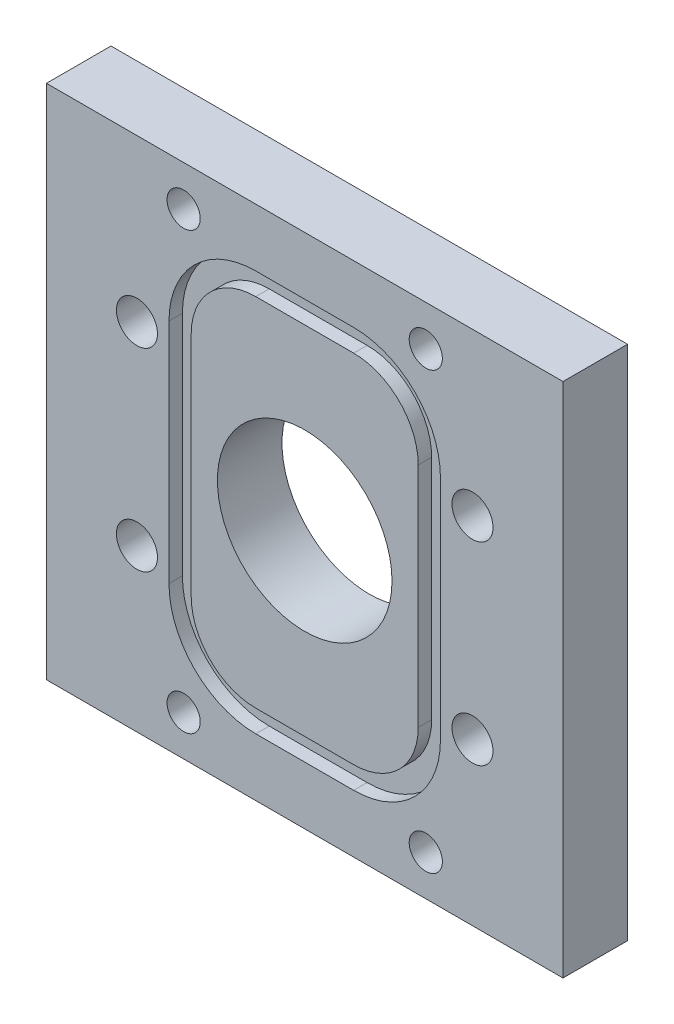
ISO-10303-21;
HEADER;
FILE_DESCRIPTION(('STEP AP214'),'2;1');
FILE_NAME('part.step','',(''),(''),'','','');
FILE_SCHEMA(('AUTOMOTIVE_DESIGN { 1 0 10303 214 1 1 1 1 }'));
ENDSEC;
DATA;
#1=APPLICATION_CONTEXT('core data for automotive mechanical design processes');
#2=APPLICATION_PROTOCOL_DEFINITION('international standard','automotive_design',2000,#1);
#3=PRODUCT_CONTEXT('',#1,'mechanical');
#4=PRODUCT('Part','Part','',(#3));
#5=PRODUCT_RELATED_PRODUCT_CATEGORY('part','',(#4));
#6=PRODUCT_DEFINITION_FORMATION('','',#4);
#7=PRODUCT_DEFINITION_CONTEXT('part definition',#1,'design');
#8=PRODUCT_DEFINITION('design','',#6,#7);
#9=PRODUCT_DEFINITION_SHAPE('','',#8);
#10=(LENGTH_UNIT() NAMED_UNIT(*) SI_UNIT(.MILLI.,.METRE.));
#11=(NAMED_UNIT(*) PLANE_ANGLE_UNIT() SI_UNIT($,.RADIAN.));
#12=(NAMED_UNIT(*) SI_UNIT($,.STERADIAN.) SOLID_ANGLE_UNIT());
#13=UNCERTAINTY_MEASURE_WITH_UNIT(LENGTH_MEASURE(1.E-05),#10,'distance_accuracy_value','');
#14=(GEOMETRIC_REPRESENTATION_CONTEXT(3) GLOBAL_UNCERTAINTY_ASSIGNED_CONTEXT((#13)) GLOBAL_UNIT_ASSIGNED_CONTEXT((#10,
#11,#12)) REPRESENTATION_CONTEXT('',''));
#15=CARTESIAN_POINT('',(0.,0.,0.));
#16=DIRECTION('',(0.,0.,1.));
#17=DIRECTION('',(1.,0.,0.));
#18=AXIS2_PLACEMENT_3D('',#15,#16,#17);
#19=CARTESIAN_POINT('',(25.4,25.4,6.35));
#20=DIRECTION('',(0.,0.,-1.));
#21=DIRECTION('',(-1.,0.,0.));
#22=AXIS2_PLACEMENT_3D('',#19,#20,#21);
#23=PLANE('',#22);
#24=CARTESIAN_POINT('',(0.,0.,6.35));
#25=DIRECTION('',(0.,0.,1.));
#26=DIRECTION('',(1.,0.,0.));
#27=AXIS2_PLACEMENT_3D('',#24,#25,#26);
#28=CIRCLE('',#27,8.5852);
#29=CARTESIAN_POINT('',(8.5852,0.,6.35));
#30=VERTEX_POINT('',#29);
#31=EDGE_CURVE('E296',#30,#30,#28,.T.);
#32=ORIENTED_EDGE('',*,*,#31,.F.);
#33=EDGE_LOOP('',(#32));
#34=FACE_BOUND('',#33,.T.);
#35=CARTESIAN_POINT('',(-4.8133,-11.176,6.35));
#36=DIRECTION('',(0.,0.,1.));
#37=DIRECTION('',(-1.,0.,0.));
#38=AXIS2_PLACEMENT_3D('',#35,#36,#37);
#39=CIRCLE('',#38,6.35);
#40=CARTESIAN_POINT('',(-11.1633,-11.176,6.35));
#41=VERTEX_POINT('',#40);
#42=CARTESIAN_POINT('',(-4.8133,-17.526,6.35));
#43=VERTEX_POINT('',#42);
#44=EDGE_CURVE('E220',#41,#43,#39,.T.);
#45=ORIENTED_EDGE('',*,*,#44,.T.);
#46=DIRECTION('',(1.,0.,0.));
#47=VECTOR('',#46,1.);
#48=CARTESIAN_POINT('',(-4.8133,-17.526,6.35));
#49=LINE('',#48,#47);
#50=CARTESIAN_POINT('',(4.8133,-17.526,6.35));
#51=VERTEX_POINT('',#50);
#52=EDGE_CURVE('E176',#43,#51,#49,.T.);
#53=ORIENTED_EDGE('',*,*,#52,.T.);
#54=CARTESIAN_POINT('',(4.8133,-11.176,6.35));
#55=DIRECTION('',(0.,0.,1.));
#56=DIRECTION('',(1.,0.,0.));
#57=AXIS2_PLACEMENT_3D('',#54,#55,#56);
#58=CIRCLE('',#57,6.35);
#59=CARTESIAN_POINT('',(11.1633,-11.176,6.35));
#60=VERTEX_POINT('',#59);
#61=EDGE_CURVE('E56',#51,#60,#58,.T.);
#62=ORIENTED_EDGE('',*,*,#61,.T.);
#63=DIRECTION('',(0.,1.,0.));
#64=VECTOR('',#63,1.);
#65=CARTESIAN_POINT('',(11.1633,-11.176,6.35));
#66=LINE('',#65,#64);
#67=CARTESIAN_POINT('',(11.1633,11.176,6.35));
#68=VERTEX_POINT('',#67);
#69=EDGE_CURVE('E224',#60,#68,#66,.T.);
#70=ORIENTED_EDGE('',*,*,#69,.T.);
#71=CARTESIAN_POINT('',(4.8133,11.176,6.35));
#72=DIRECTION('',(0.,0.,1.));
#73=DIRECTION('',(-1.,0.,0.));
#74=AXIS2_PLACEMENT_3D('',#71,#72,#73);
#75=CIRCLE('',#74,6.35);
#76=CARTESIAN_POINT('',(4.8133,17.526,6.35));
#77=VERTEX_POINT('',#76);
#78=EDGE_CURVE('E227',#68,#77,#75,.T.);
#79=ORIENTED_EDGE('',*,*,#78,.T.);
#80=DIRECTION('',(-1.,0.,0.));
#81=VECTOR('',#80,1.);
#82=CARTESIAN_POINT('',(-4.8133,17.526,6.35));
#83=LINE('',#82,#81);
#84=CARTESIAN_POINT('',(-4.8133,17.526,6.35));
#85=VERTEX_POINT('',#84);
#86=EDGE_CURVE('E230',#77,#85,#83,.T.);
#87=ORIENTED_EDGE('',*,*,#86,.T.);
#88=CARTESIAN_POINT('',(-4.8133,11.176,6.35));
#89=DIRECTION('',(0.,0.,1.));
#90=DIRECTION('',(-1.,0.,0.));
#91=AXIS2_PLACEMENT_3D('',#88,#89,#90);
#92=CIRCLE('',#91,6.35);
#93=CARTESIAN_POINT('',(-11.1633,11.176,6.35));
#94=VERTEX_POINT('',#93);
#95=EDGE_CURVE('E200',#85,#94,#92,.T.);
#96=ORIENTED_EDGE('',*,*,#95,.T.);
#97=DIRECTION('',(0.,-1.,0.));
#98=VECTOR('',#97,1.);
#99=CARTESIAN_POINT('',(-11.1633,-11.176,6.35));
#100=LINE('',#99,#98);
#101=EDGE_CURVE('E197',#94,#41,#100,.T.);
#102=ORIENTED_EDGE('',*,*,#101,.T.);
#103=EDGE_LOOP('',(#45,#53,#62,#70,#79,#87,#96,#102));
#104=FACE_BOUND('',#103,.T.);
#105=ADVANCED_FACE('F32',(#34,#104),#23,.F.);
#106=CARTESIAN_POINT('',(25.4,-25.4,6.35));
#107=DIRECTION('',(-1.,0.,0.));
#108=DIRECTION('',(0.,0.,1.));
#109=AXIS2_PLACEMENT_3D('',#106,#107,#108);
#110=PLANE('',#109);
#111=DIRECTION('',(0.,1.,0.));
#112=VECTOR('',#111,1.);
#113=CARTESIAN_POINT('',(25.4,-25.4,0.));
#114=LINE('',#113,#112);
#115=CARTESIAN_POINT('',(25.4,-25.4,0.));
#116=VERTEX_POINT('',#115);
#117=CARTESIAN_POINT('',(25.4,25.4,0.));
#118=VERTEX_POINT('',#117);
#119=EDGE_CURVE('E313',#116,#118,#114,.T.);
#120=ORIENTED_EDGE('',*,*,#119,.T.);
#121=DIRECTION('',(0.,0.,-1.));
#122=VECTOR('',#121,1.);
#123=CARTESIAN_POINT('',(25.4,25.4,6.35));
#124=LINE('',#123,#122);
#125=CARTESIAN_POINT('',(25.4,25.4,6.35));
#126=VERTEX_POINT('',#125);
#127=EDGE_CURVE('E11',#126,#118,#124,.T.);
#128=ORIENTED_EDGE('',*,*,#127,.F.);
#129=DIRECTION('',(0.,1.,0.));
#130=VECTOR('',#129,1.);
#131=CARTESIAN_POINT('',(25.4,-25.4,6.35));
#132=LINE('',#131,#130);
#133=CARTESIAN_POINT('',(25.4,-25.4,6.35));
#134=VERTEX_POINT('',#133);
#135=EDGE_CURVE('E316',#134,#126,#132,.T.);
#136=ORIENTED_EDGE('',*,*,#135,.F.);
#137=DIRECTION('',(0.,0.,-1.));
#138=VECTOR('',#137,1.);
#139=CARTESIAN_POINT('',(25.4,-25.4,6.35));
#140=LINE('',#139,#138);
#141=EDGE_CURVE('E326',#134,#116,#140,.T.);
#142=ORIENTED_EDGE('',*,*,#141,.T.);
#143=EDGE_LOOP('',(#120,#128,#136,#142));
#144=FACE_BOUND('',#143,.T.);
#145=ADVANCED_FACE('F34',(#144),#110,.F.);
#146=CARTESIAN_POINT('',(-25.4,25.4,6.35));
#147=DIRECTION('',(0.,-1.,0.));
#148=DIRECTION('',(0.,0.,-1.));
#149=AXIS2_PLACEMENT_3D('',#146,#147,#148);
#150=PLANE('',#149);
#151=DIRECTION('',(-1.,0.,0.));
#152=VECTOR('',#151,1.);
#153=CARTESIAN_POINT('',(-25.4,25.4,0.));
#154=LINE('',#153,#152);
#155=CARTESIAN_POINT('',(-25.4,25.4,0.));
#156=VERTEX_POINT('',#155);
#157=EDGE_CURVE('E329',#118,#156,#154,.T.);
#158=ORIENTED_EDGE('',*,*,#157,.T.);
#159=DIRECTION('',(0.,0.,-1.));
#160=VECTOR('',#159,1.);
#161=CARTESIAN_POINT('',(-25.4,25.4,6.35));
#162=LINE('',#161,#160);
#163=CARTESIAN_POINT('',(-25.4,25.4,6.35));
#164=VERTEX_POINT('',#163);
#165=EDGE_CURVE('E41',#164,#156,#162,.T.);
#166=ORIENTED_EDGE('',*,*,#165,.F.);
#167=DIRECTION('',(-1.,0.,0.));
#168=VECTOR('',#167,1.);
#169=CARTESIAN_POINT('',(-25.4,25.4,6.35));
#170=LINE('',#169,#168);
#171=EDGE_CURVE('E319',#126,#164,#170,.T.);
#172=ORIENTED_EDGE('',*,*,#171,.F.);
#173=ORIENTED_EDGE('',*,*,#127,.T.);
#174=EDGE_LOOP('',(#158,#166,#172,#173));
#175=FACE_BOUND('',#174,.T.);
#176=ADVANCED_FACE('F360',(#175),#150,.F.);
#177=CARTESIAN_POINT('',(-25.4,-25.4,6.35));
#178=DIRECTION('',(1.,0.,0.));
#179=DIRECTION('',(0.,0.,-1.));
#180=AXIS2_PLACEMENT_3D('',#177,#178,#179);
#181=PLANE('',#180);
#182=DIRECTION('',(0.,-1.,0.));
#183=VECTOR('',#182,1.);
#184=CARTESIAN_POINT('',(-25.4,-25.4,0.));
#185=LINE('',#184,#183);
#186=CARTESIAN_POINT('',(-25.4,-25.4,0.));
#187=VERTEX_POINT('',#186);
#188=EDGE_CURVE('E331',#156,#187,#185,.T.);
#189=ORIENTED_EDGE('',*,*,#188,.T.);
#190=DIRECTION('',(0.,0.,-1.));
#191=VECTOR('',#190,1.);
#192=CARTESIAN_POINT('',(-25.4,-25.4,6.35));
#193=LINE('',#192,#191);
#194=CARTESIAN_POINT('',(-25.4,-25.4,6.35));
#195=VERTEX_POINT('',#194);
#196=EDGE_CURVE('E336',#195,#187,#193,.T.);
#197=ORIENTED_EDGE('',*,*,#196,.F.);
#198=DIRECTION('',(0.,-1.,0.));
#199=VECTOR('',#198,1.);
#200=CARTESIAN_POINT('',(-25.4,-25.4,6.35));
#201=LINE('',#200,#199);
#202=EDGE_CURVE('E322',#164,#195,#201,.T.);
#203=ORIENTED_EDGE('',*,*,#202,.F.);
#204=ORIENTED_EDGE('',*,*,#165,.T.);
#205=EDGE_LOOP('',(#189,#197,#203,#204));
#206=FACE_BOUND('',#205,.T.);
#207=ADVANCED_FACE('F344',(#206),#181,.F.);
#208=CARTESIAN_POINT('',(-25.4,-25.4,6.35));
#209=DIRECTION('',(0.,1.,0.));
#210=DIRECTION('',(0.,0.,1.));
#211=AXIS2_PLACEMENT_3D('',#208,#209,#210);
#212=PLANE('',#211);
#213=DIRECTION('',(1.,0.,0.));
#214=VECTOR('',#213,1.);
#215=CARTESIAN_POINT('',(-25.4,-25.4,0.));
#216=LINE('',#215,#214);
#217=EDGE_CURVE('E320',#187,#116,#216,.T.);
#218=ORIENTED_EDGE('',*,*,#217,.T.);
#219=ORIENTED_EDGE('',*,*,#141,.F.);
#220=DIRECTION('',(1.,0.,0.));
#221=VECTOR('',#220,1.);
#222=CARTESIAN_POINT('',(-25.4,-25.4,6.35));
#223=LINE('',#222,#221);
#224=EDGE_CURVE('E324',#195,#134,#223,.T.);
#225=ORIENTED_EDGE('',*,*,#224,.F.);
#226=ORIENTED_EDGE('',*,*,#196,.T.);
#227=EDGE_LOOP('',(#218,#219,#225,#226));
#228=FACE_BOUND('',#227,.T.);
#229=ADVANCED_FACE('F353',(#228),#212,.F.);
#230=CARTESIAN_POINT('',(16.4977839420935,9.52500000000003,6.35));
#231=DIRECTION('',(0.,0.,-1.));
#232=DIRECTION('',(-1.,0.,0.));
#233=AXIS2_PLACEMENT_3D('',#230,#231,#232);
#234=CIRCLE('',#233,2.0193);
#235=CARTESIAN_POINT('',(14.4784839420935,9.52500000000003,6.35));
#236=VERTEX_POINT('',#235);
#237=EDGE_CURVE('E388',#236,#236,#234,.T.);
#238=ORIENTED_EDGE('',*,*,#237,.T.);
#239=EDGE_LOOP('',(#238));
#240=FACE_BOUND('',#239,.T.);
#241=CARTESIAN_POINT('',(16.4977839420935,-9.52500000000002,6.35));
#242=DIRECTION('',(0.,0.,-1.));
#243=DIRECTION('',(-1.,0.,0.));
#244=AXIS2_PLACEMENT_3D('',#241,#242,#243);
#245=CIRCLE('',#244,2.0193);
#246=CARTESIAN_POINT('',(14.4784839420935,-9.52500000000002,6.35));
#247=VERTEX_POINT('',#246);
#248=EDGE_CURVE('E392',#247,#247,#245,.T.);
#249=ORIENTED_EDGE('',*,*,#248,.T.);
#250=EDGE_LOOP('',(#249));
#251=FACE_BOUND('',#250,.T.);
#252=CARTESIAN_POINT('',(-16.4977839420935,9.52500000000003,6.35));
#253=DIRECTION('',(0.,0.,-1.));
#254=DIRECTION('',(-1.,0.,0.));
#255=AXIS2_PLACEMENT_3D('',#252,#253,#254);
#256=CIRCLE('',#255,2.0193);
#257=CARTESIAN_POINT('',(-18.5170839420935,9.52500000000003,6.35));
#258=VERTEX_POINT('',#257);
#259=EDGE_CURVE('E36',#258,#258,#256,.T.);
#260=ORIENTED_EDGE('',*,*,#259,.T.);
#261=EDGE_LOOP('',(#260));
#262=FACE_BOUND('',#261,.T.);
#263=CARTESIAN_POINT('',(-16.4977839420935,-9.52500000000002,6.35));
#264=DIRECTION('',(0.,0.,-1.));
#265=DIRECTION('',(-1.,0.,0.));
#266=AXIS2_PLACEMENT_3D('',#263,#264,#265);
#267=CIRCLE('',#266,2.0193);
#268=CARTESIAN_POINT('',(-18.5170839420935,-9.52500000000002,6.35));
#269=VERTEX_POINT('',#268);
#270=EDGE_CURVE('E399',#269,#269,#267,.T.);
#271=ORIENTED_EDGE('',*,*,#270,.T.);
#272=EDGE_LOOP('',(#271));
#273=FACE_BOUND('',#272,.T.);
#274=CARTESIAN_POINT('',(11.90625,21.43125,6.35));
#275=DIRECTION('',(0.,0.,-1.));
#276=DIRECTION('',(-1.,0.,0.));
#277=AXIS2_PLACEMENT_3D('',#274,#275,#276);
#278=CIRCLE('',#277,1.63195);
#279=CARTESIAN_POINT('',(10.2743,21.43125,6.35));
#280=VERTEX_POINT('',#279);
#281=EDGE_CURVE('E403',#280,#280,#278,.T.);
#282=ORIENTED_EDGE('',*,*,#281,.T.);
#283=EDGE_LOOP('',(#282));
#284=FACE_BOUND('',#283,.T.);
#285=CARTESIAN_POINT('',(-11.90625,21.43125,6.35));
#286=DIRECTION('',(0.,0.,-1.));
#287=DIRECTION('',(-1.,0.,0.));
#288=AXIS2_PLACEMENT_3D('',#285,#286,#287);
#289=CIRCLE('',#288,1.63195);
#290=CARTESIAN_POINT('',(-13.5382,21.43125,6.35));
#291=VERTEX_POINT('',#290);
#292=EDGE_CURVE('E407',#291,#291,#289,.T.);
#293=ORIENTED_EDGE('',*,*,#292,.T.);
#294=EDGE_LOOP('',(#293));
#295=FACE_BOUND('',#294,.T.);
#296=CARTESIAN_POINT('',(11.90625,-21.43125,6.35));
#297=DIRECTION('',(0.,0.,-1.));
#298=DIRECTION('',(-1.,0.,0.));
#299=AXIS2_PLACEMENT_3D('',#296,#297,#298);
#300=CIRCLE('',#299,1.63195);
#301=CARTESIAN_POINT('',(10.2743,-21.43125,6.35));
#302=VERTEX_POINT('',#301);
#303=EDGE_CURVE('E411',#302,#302,#300,.T.);
#304=ORIENTED_EDGE('',*,*,#303,.T.);
#305=EDGE_LOOP('',(#304));
#306=FACE_BOUND('',#305,.T.);
#307=CARTESIAN_POINT('',(-11.90625,-21.43125,6.35));
#308=DIRECTION('',(0.,0.,-1.));
#309=DIRECTION('',(-1.,0.,0.));
#310=AXIS2_PLACEMENT_3D('',#307,#308,#309);
#311=CIRCLE('',#310,1.63195);
#312=CARTESIAN_POINT('',(-13.5382,-21.43125,6.35));
#313=VERTEX_POINT('',#312);
#314=EDGE_CURVE('E203',#313,#313,#311,.T.);
#315=ORIENTED_EDGE('',*,*,#314,.T.);
#316=EDGE_LOOP('',(#315));
#317=FACE_BOUND('',#316,.T.);
#318=DIRECTION('',(-1.,0.,0.));
#319=VECTOR('',#318,1.);
#320=CARTESIAN_POINT('',(-4.8133,19.7104,6.35));
#321=LINE('',#320,#319);
#322=CARTESIAN_POINT('',(4.8133,19.7104,6.35));
#323=VERTEX_POINT('',#322);
#324=CARTESIAN_POINT('',(-4.8133,19.7104,6.35));
#325=VERTEX_POINT('',#324);
#326=EDGE_CURVE('E274',#323,#325,#321,.T.);
#327=ORIENTED_EDGE('',*,*,#326,.F.);
#328=CARTESIAN_POINT('',(4.8133,11.176,6.35));
#329=DIRECTION('',(0.,0.,1.));
#330=DIRECTION('',(-1.,0.,0.));
#331=AXIS2_PLACEMENT_3D('',#328,#329,#330);
#332=CIRCLE('',#331,8.5344);
#333=CARTESIAN_POINT('',(13.3477,11.176,6.35));
#334=VERTEX_POINT('',#333);
#335=EDGE_CURVE('E48',#334,#323,#332,.T.);
#336=ORIENTED_EDGE('',*,*,#335,.F.);
#337=DIRECTION('',(0.,1.,0.));
#338=VECTOR('',#337,1.);
#339=CARTESIAN_POINT('',(13.3477,-11.176,6.35));
#340=LINE('',#339,#338);
#341=CARTESIAN_POINT('',(13.3477,-11.176,6.35));
#342=VERTEX_POINT('',#341);
#343=EDGE_CURVE('E251',#342,#334,#340,.T.);
#344=ORIENTED_EDGE('',*,*,#343,.F.);
#345=CARTESIAN_POINT('',(4.8133,-11.176,6.35));
#346=DIRECTION('',(0.,0.,1.));
#347=DIRECTION('',(1.,0.,0.));
#348=AXIS2_PLACEMENT_3D('',#345,#346,#347);
#349=CIRCLE('',#348,8.5344);
#350=CARTESIAN_POINT('',(4.8133,-19.7104,6.35));
#351=VERTEX_POINT('',#350);
#352=EDGE_CURVE('E289',#351,#342,#349,.T.);
#353=ORIENTED_EDGE('',*,*,#352,.F.);
#354=DIRECTION('',(1.,0.,0.));
#355=VECTOR('',#354,1.);
#356=CARTESIAN_POINT('',(-4.8133,-19.7104,6.35));
#357=LINE('',#356,#355);
#358=CARTESIAN_POINT('',(-4.8133,-19.7104,6.35));
#359=VERTEX_POINT('',#358);
#360=EDGE_CURVE('E286',#359,#351,#357,.T.);
#361=ORIENTED_EDGE('',*,*,#360,.F.);
#362=CARTESIAN_POINT('',(-4.8133,-11.176,6.35));
#363=DIRECTION('',(0.,0.,1.));
#364=DIRECTION('',(-1.,0.,0.));
#365=AXIS2_PLACEMENT_3D('',#362,#363,#364);
#366=CIRCLE('',#365,8.5344);
#367=CARTESIAN_POINT('',(-13.3477,-11.176,6.35));
#368=VERTEX_POINT('',#367);
#369=EDGE_CURVE('E283',#368,#359,#366,.T.);
#370=ORIENTED_EDGE('',*,*,#369,.F.);
#371=DIRECTION('',(0.,-1.,0.));
#372=VECTOR('',#371,1.);
#373=CARTESIAN_POINT('',(-13.3477,-11.176,6.35));
#374=LINE('',#373,#372);
#375=CARTESIAN_POINT('',(-13.3477,11.176,6.35));
#376=VERTEX_POINT('',#375);
#377=EDGE_CURVE('E280',#376,#368,#374,.T.);
#378=ORIENTED_EDGE('',*,*,#377,.F.);
#379=CARTESIAN_POINT('',(-4.8133,11.176,6.35));
#380=DIRECTION('',(0.,0.,1.));
#381=DIRECTION('',(-1.,0.,0.));
#382=AXIS2_PLACEMENT_3D('',#379,#380,#381);
#383=CIRCLE('',#382,8.5344);
#384=EDGE_CURVE('E277',#325,#376,#383,.T.);
#385=ORIENTED_EDGE('',*,*,#384,.F.);
#386=EDGE_LOOP('',(#327,#336,#344,#353,#361,#370,#378,#385));
#387=FACE_BOUND('',#386,.T.);
#388=ORIENTED_EDGE('',*,*,#135,.T.);
#389=ORIENTED_EDGE('',*,*,#171,.T.);
#390=ORIENTED_EDGE('',*,*,#202,.T.);
#391=ORIENTED_EDGE('',*,*,#224,.T.);
#392=EDGE_LOOP('',(#388,#389,#390,#391));
#393=FACE_BOUND('',#392,.T.);
#394=ADVANCED_FACE('F359',(#240,#251,#262,#273,#284,#295,#306,#317,#387,#393),#23,.F.);
#395=CARTESIAN_POINT('',(25.4,25.4,0.));
#396=DIRECTION('',(0.,0.,-1.));
#397=DIRECTION('',(-1.,0.,0.));
#398=AXIS2_PLACEMENT_3D('',#395,#396,#397);
#399=PLANE('',#398);
#400=CARTESIAN_POINT('',(16.4977839420935,9.52500000000003,0.));
#401=DIRECTION('',(0.,0.,-1.));
#402=DIRECTION('',(-1.,0.,0.));
#403=AXIS2_PLACEMENT_3D('',#400,#401,#402);
#404=CIRCLE('',#403,2.0193);
#405=CARTESIAN_POINT('',(14.4784839420935,9.52500000000003,0.));
#406=VERTEX_POINT('',#405);
#407=EDGE_CURVE('E726',#406,#406,#404,.T.);
#408=ORIENTED_EDGE('',*,*,#407,.F.);
#409=EDGE_LOOP('',(#408));
#410=FACE_BOUND('',#409,.T.);
#411=CARTESIAN_POINT('',(16.4977839420935,-9.52500000000002,0.));
#412=DIRECTION('',(0.,0.,-1.));
#413=DIRECTION('',(-1.,0.,0.));
#414=AXIS2_PLACEMENT_3D('',#411,#412,#413);
#415=CIRCLE('',#414,2.0193);
#416=CARTESIAN_POINT('',(14.4784839420935,-9.52500000000002,0.));
#417=VERTEX_POINT('',#416);
#418=EDGE_CURVE('E727',#417,#417,#415,.T.);
#419=ORIENTED_EDGE('',*,*,#418,.F.);
#420=EDGE_LOOP('',(#419));
#421=FACE_BOUND('',#420,.T.);
#422=CARTESIAN_POINT('',(-16.4977839420935,9.52500000000003,0.));
#423=DIRECTION('',(0.,0.,-1.));
#424=DIRECTION('',(-1.,0.,0.));
#425=AXIS2_PLACEMENT_3D('',#422,#423,#424);
#426=CIRCLE('',#425,2.0193);
#427=CARTESIAN_POINT('',(-18.5170839420935,9.52500000000003,0.));
#428=VERTEX_POINT('',#427);
#429=EDGE_CURVE('E734',#428,#428,#426,.T.);
#430=ORIENTED_EDGE('',*,*,#429,.F.);
#431=EDGE_LOOP('',(#430));
#432=FACE_BOUND('',#431,.T.);
#433=CARTESIAN_POINT('',(-16.4977839420935,-9.52500000000002,0.));
#434=DIRECTION('',(0.,0.,-1.));
#435=DIRECTION('',(-1.,0.,0.));
#436=AXIS2_PLACEMENT_3D('',#433,#434,#435);
#437=CIRCLE('',#436,2.0193);
#438=CARTESIAN_POINT('',(-18.5170839420935,-9.52500000000002,0.));
#439=VERTEX_POINT('',#438);
#440=EDGE_CURVE('E737',#439,#439,#437,.T.);
#441=ORIENTED_EDGE('',*,*,#440,.F.);
#442=EDGE_LOOP('',(#441));
#443=FACE_BOUND('',#442,.T.);
#444=CARTESIAN_POINT('',(11.90625,21.43125,0.));
#445=DIRECTION('',(0.,0.,-1.));
#446=DIRECTION('',(-1.,0.,0.));
#447=AXIS2_PLACEMENT_3D('',#444,#445,#446);
#448=CIRCLE('',#447,2.8575);
#449=CARTESIAN_POINT('',(9.04875,21.43125,0.));
#450=VERTEX_POINT('',#449);
#451=EDGE_CURVE('E741',#450,#450,#448,.T.);
#452=ORIENTED_EDGE('',*,*,#451,.F.);
#453=EDGE_LOOP('',(#452));
#454=FACE_BOUND('',#453,.T.);
#455=CARTESIAN_POINT('',(-11.90625,21.43125,0.));
#456=DIRECTION('',(0.,0.,-1.));
#457=DIRECTION('',(-1.,0.,0.));
#458=AXIS2_PLACEMENT_3D('',#455,#456,#457);
#459=CIRCLE('',#458,2.8575);
#460=CARTESIAN_POINT('',(-14.76375,21.43125,0.));
#461=VERTEX_POINT('',#460);
#462=EDGE_CURVE('E748',#461,#461,#459,.T.);
#463=ORIENTED_EDGE('',*,*,#462,.F.);
#464=EDGE_LOOP('',(#463));
#465=FACE_BOUND('',#464,.T.);
#466=CARTESIAN_POINT('',(11.90625,-21.43125,0.));
#467=DIRECTION('',(0.,0.,-1.));
#468=DIRECTION('',(-1.,0.,0.));
#469=AXIS2_PLACEMENT_3D('',#466,#467,#468);
#470=CIRCLE('',#469,2.8575);
#471=CARTESIAN_POINT('',(9.04875,-21.43125,0.));
#472=VERTEX_POINT('',#471);
#473=EDGE_CURVE('E755',#472,#472,#470,.T.);
#474=ORIENTED_EDGE('',*,*,#473,.F.);
#475=EDGE_LOOP('',(#474));
#476=FACE_BOUND('',#475,.T.);
#477=CARTESIAN_POINT('',(-11.90625,-21.43125,0.));
#478=DIRECTION('',(0.,0.,-1.));
#479=DIRECTION('',(-1.,0.,0.));
#480=AXIS2_PLACEMENT_3D('',#477,#478,#479);
#481=CIRCLE('',#480,2.8575);
#482=CARTESIAN_POINT('',(-14.76375,-21.43125,0.));
#483=VERTEX_POINT('',#482);
#484=EDGE_CURVE('E762',#483,#483,#481,.T.);
#485=ORIENTED_EDGE('',*,*,#484,.F.);
#486=EDGE_LOOP('',(#485));
#487=FACE_BOUND('',#486,.T.);
#488=CARTESIAN_POINT('',(0.,0.,0.));
#489=DIRECTION('',(0.,0.,1.));
#490=DIRECTION('',(1.,0.,0.));
#491=AXIS2_PLACEMENT_3D('',#488,#489,#490);
#492=CIRCLE('',#491,8.5852);
#493=CARTESIAN_POINT('',(8.5852,0.,0.));
#494=VERTEX_POINT('',#493);
#495=EDGE_CURVE('E310',#494,#494,#492,.T.);
#496=ORIENTED_EDGE('',*,*,#495,.T.);
#497=EDGE_LOOP('',(#496));
#498=FACE_BOUND('',#497,.T.);
#499=ORIENTED_EDGE('',*,*,#119,.F.);
#500=ORIENTED_EDGE('',*,*,#217,.F.);
#501=ORIENTED_EDGE('',*,*,#188,.F.);
#502=ORIENTED_EDGE('',*,*,#157,.F.);
#503=EDGE_LOOP('',(#499,#500,#501,#502));
#504=FACE_BOUND('',#503,.T.);
#505=ADVANCED_FACE('F350',(#410,#421,#432,#443,#454,#465,#476,#487,#498,#504),#399,.T.);
#506=CARTESIAN_POINT('',(0.,0.,0.));
#507=DIRECTION('',(0.,0.,1.));
#508=DIRECTION('',(1.,0.,0.));
#509=AXIS2_PLACEMENT_3D('',#506,#507,#508);
#510=CYLINDRICAL_SURFACE('',#509,8.5852);
#511=ORIENTED_EDGE('',*,*,#495,.F.);
#512=EDGE_LOOP('',(#511));
#513=FACE_BOUND('',#512,.T.);
#514=ORIENTED_EDGE('',*,*,#31,.T.);
#515=EDGE_LOOP('',(#514));
#516=FACE_BOUND('',#515,.T.);
#517=ADVANCED_FACE('F382',(#513,#516),#510,.F.);
#518=CARTESIAN_POINT('',(4.8133,11.176,5.0292));
#519=DIRECTION('',(0.,0.,1.));
#520=DIRECTION('',(1.,0.,0.));
#521=AXIS2_PLACEMENT_3D('',#518,#519,#520);
#522=CYLINDRICAL_SURFACE('',#521,8.5344);
#523=ORIENTED_EDGE('',*,*,#335,.T.);
#524=DIRECTION('',(0.,0.,1.));
#525=VECTOR('',#524,1.);
#526=CARTESIAN_POINT('',(4.8133,19.7104,5.0292));
#527=LINE('',#526,#525);
#528=CARTESIAN_POINT('',(4.8133,19.7104,5.0292));
#529=VERTEX_POINT('',#528);
#530=EDGE_CURVE('E272',#529,#323,#527,.T.);
#531=ORIENTED_EDGE('',*,*,#530,.F.);
#532=CARTESIAN_POINT('',(4.8133,11.176,5.0292));
#533=DIRECTION('',(0.,0.,1.));
#534=DIRECTION('',(-1.,0.,0.));
#535=AXIS2_PLACEMENT_3D('',#532,#533,#534);
#536=CIRCLE('',#535,8.5344);
#537=CARTESIAN_POINT('',(13.3477,11.176,5.0292));
#538=VERTEX_POINT('',#537);
#539=EDGE_CURVE('E247',#538,#529,#536,.T.);
#540=ORIENTED_EDGE('',*,*,#539,.F.);
#541=DIRECTION('',(0.,0.,1.));
#542=VECTOR('',#541,1.);
#543=CARTESIAN_POINT('',(13.3477,11.176,5.0292));
#544=LINE('',#543,#542);
#545=EDGE_CURVE('E294',#538,#334,#544,.T.);
#546=ORIENTED_EDGE('',*,*,#545,.T.);
#547=EDGE_LOOP('',(#523,#531,#540,#546));
#548=FACE_BOUND('',#547,.T.);
#549=ADVANCED_FACE('F424',(#548),#522,.F.);
#550=CARTESIAN_POINT('',(13.3477,-11.176,5.0292));
#551=DIRECTION('',(1.,0.,0.));
#552=DIRECTION('',(0.,0.,-1.));
#553=AXIS2_PLACEMENT_3D('',#550,#551,#552);
#554=PLANE('',#553);
#555=ORIENTED_EDGE('',*,*,#343,.T.);
#556=ORIENTED_EDGE('',*,*,#545,.F.);
#557=DIRECTION('',(0.,1.,0.));
#558=VECTOR('',#557,1.);
#559=CARTESIAN_POINT('',(13.3477,-11.176,5.0292));
#560=LINE('',#559,#558);
#561=CARTESIAN_POINT('',(13.3477,-11.176,5.0292));
#562=VERTEX_POINT('',#561);
#563=EDGE_CURVE('E269',#562,#538,#560,.T.);
#564=ORIENTED_EDGE('',*,*,#563,.F.);
#565=DIRECTION('',(0.,0.,1.));
#566=VECTOR('',#565,1.);
#567=CARTESIAN_POINT('',(13.3477,-11.176,5.0292));
#568=LINE('',#567,#566);
#569=EDGE_CURVE('E297',#562,#342,#568,.T.);
#570=ORIENTED_EDGE('',*,*,#569,.T.);
#571=EDGE_LOOP('',(#555,#556,#564,#570));
#572=FACE_BOUND('',#571,.T.);
#573=ADVANCED_FACE('F428',(#572),#554,.F.);
#574=CARTESIAN_POINT('',(4.8133,-11.176,5.0292));
#575=DIRECTION('',(0.,0.,1.));
#576=DIRECTION('',(1.,0.,0.));
#577=AXIS2_PLACEMENT_3D('',#574,#575,#576);
#578=CYLINDRICAL_SURFACE('',#577,8.5344);
#579=ORIENTED_EDGE('',*,*,#352,.T.);
#580=ORIENTED_EDGE('',*,*,#569,.F.);
#581=CARTESIAN_POINT('',(4.8133,-11.176,5.0292));
#582=DIRECTION('',(0.,0.,1.));
#583=DIRECTION('',(1.,0.,0.));
#584=AXIS2_PLACEMENT_3D('',#581,#582,#583);
#585=CIRCLE('',#584,8.5344);
#586=CARTESIAN_POINT('',(4.8133,-19.7104,5.0292));
#587=VERTEX_POINT('',#586);
#588=EDGE_CURVE('E266',#587,#562,#585,.T.);
#589=ORIENTED_EDGE('',*,*,#588,.F.);
#590=DIRECTION('',(0.,0.,1.));
#591=VECTOR('',#590,1.);
#592=CARTESIAN_POINT('',(4.8133,-19.7104,5.0292));
#593=LINE('',#592,#591);
#594=EDGE_CURVE('E299',#587,#351,#593,.T.);
#595=ORIENTED_EDGE('',*,*,#594,.T.);
#596=EDGE_LOOP('',(#579,#580,#589,#595));
#597=FACE_BOUND('',#596,.T.);
#598=ADVANCED_FACE('F433',(#597),#578,.F.);
#599=CARTESIAN_POINT('',(-4.8133,-19.7104,5.0292));
#600=DIRECTION('',(0.,-1.,0.));
#601=DIRECTION('',(0.,0.,-1.));
#602=AXIS2_PLACEMENT_3D('',#599,#600,#601);
#603=PLANE('',#602);
#604=ORIENTED_EDGE('',*,*,#360,.T.);
#605=ORIENTED_EDGE('',*,*,#594,.F.);
#606=DIRECTION('',(1.,0.,0.));
#607=VECTOR('',#606,1.);
#608=CARTESIAN_POINT('',(-4.8133,-19.7104,5.0292));
#609=LINE('',#608,#607);
#610=CARTESIAN_POINT('',(-4.8133,-19.7104,5.0292));
#611=VERTEX_POINT('',#610);
#612=EDGE_CURVE('E263',#611,#587,#609,.T.);
#613=ORIENTED_EDGE('',*,*,#612,.F.);
#614=DIRECTION('',(0.,0.,1.));
#615=VECTOR('',#614,1.);
#616=CARTESIAN_POINT('',(-4.8133,-19.7104,5.0292));
#617=LINE('',#616,#615);
#618=EDGE_CURVE('E301',#611,#359,#617,.T.);
#619=ORIENTED_EDGE('',*,*,#618,.T.);
#620=EDGE_LOOP('',(#604,#605,#613,#619));
#621=FACE_BOUND('',#620,.T.);
#622=ADVANCED_FACE('F436',(#621),#603,.F.);
#623=CARTESIAN_POINT('',(-4.8133,-11.176,5.0292));
#624=DIRECTION('',(0.,0.,1.));
#625=DIRECTION('',(1.,0.,0.));
#626=AXIS2_PLACEMENT_3D('',#623,#624,#625);
#627=CYLINDRICAL_SURFACE('',#626,8.5344);
#628=ORIENTED_EDGE('',*,*,#369,.T.);
#629=ORIENTED_EDGE('',*,*,#618,.F.);
#630=CARTESIAN_POINT('',(-4.8133,-11.176,5.0292));
#631=DIRECTION('',(0.,0.,1.));
#632=DIRECTION('',(-1.,0.,0.));
#633=AXIS2_PLACEMENT_3D('',#630,#631,#632);
#634=CIRCLE('',#633,8.5344);
#635=CARTESIAN_POINT('',(-13.3477,-11.176,5.0292));
#636=VERTEX_POINT('',#635);
#637=EDGE_CURVE('E260',#636,#611,#634,.T.);
#638=ORIENTED_EDGE('',*,*,#637,.F.);
#639=DIRECTION('',(0.,0.,1.));
#640=VECTOR('',#639,1.);
#641=CARTESIAN_POINT('',(-13.3477,-11.176,5.0292));
#642=LINE('',#641,#640);
#643=EDGE_CURVE('E303',#636,#368,#642,.T.);
#644=ORIENTED_EDGE('',*,*,#643,.T.);
#645=EDGE_LOOP('',(#628,#629,#638,#644));
#646=FACE_BOUND('',#645,.T.);
#647=ADVANCED_FACE('F439',(#646),#627,.F.);
#648=CARTESIAN_POINT('',(-13.3477,-11.176,5.0292));
#649=DIRECTION('',(-1.,0.,0.));
#650=DIRECTION('',(0.,0.,1.));
#651=AXIS2_PLACEMENT_3D('',#648,#649,#650);
#652=PLANE('',#651);
#653=ORIENTED_EDGE('',*,*,#377,.T.);
#654=ORIENTED_EDGE('',*,*,#643,.F.);
#655=DIRECTION('',(0.,-1.,0.));
#656=VECTOR('',#655,1.);
#657=CARTESIAN_POINT('',(-13.3477,-11.176,5.0292));
#658=LINE('',#657,#656);
#659=CARTESIAN_POINT('',(-13.3477,11.176,5.0292));
#660=VERTEX_POINT('',#659);
#661=EDGE_CURVE('E257',#660,#636,#658,.T.);
#662=ORIENTED_EDGE('',*,*,#661,.F.);
#663=DIRECTION('',(0.,0.,1.));
#664=VECTOR('',#663,1.);
#665=CARTESIAN_POINT('',(-13.3477,11.176,5.0292));
#666=LINE('',#665,#664);
#667=EDGE_CURVE('E305',#660,#376,#666,.T.);
#668=ORIENTED_EDGE('',*,*,#667,.T.);
#669=EDGE_LOOP('',(#653,#654,#662,#668));
#670=FACE_BOUND('',#669,.T.);
#671=ADVANCED_FACE('F441',(#670),#652,.F.);
#672=CARTESIAN_POINT('',(-4.8133,11.176,5.0292));
#673=DIRECTION('',(0.,0.,1.));
#674=DIRECTION('',(1.,0.,0.));
#675=AXIS2_PLACEMENT_3D('',#672,#673,#674);
#676=CYLINDRICAL_SURFACE('',#675,8.5344);
#677=ORIENTED_EDGE('',*,*,#384,.T.);
#678=ORIENTED_EDGE('',*,*,#667,.F.);
#679=CARTESIAN_POINT('',(-4.8133,11.176,5.0292));
#680=DIRECTION('',(0.,0.,1.));
#681=DIRECTION('',(-1.,0.,0.));
#682=AXIS2_PLACEMENT_3D('',#679,#680,#681);
#683=CIRCLE('',#682,8.5344);
#684=CARTESIAN_POINT('',(-4.8133,19.7104,5.0292));
#685=VERTEX_POINT('',#684);
#686=EDGE_CURVE('E254',#685,#660,#683,.T.);
#687=ORIENTED_EDGE('',*,*,#686,.F.);
#688=DIRECTION('',(0.,0.,1.));
#689=VECTOR('',#688,1.);
#690=CARTESIAN_POINT('',(-4.8133,19.7104,5.0292));
#691=LINE('',#690,#689);
#692=EDGE_CURVE('E307',#685,#325,#691,.T.);
#693=ORIENTED_EDGE('',*,*,#692,.T.);
#694=EDGE_LOOP('',(#677,#678,#687,#693));
#695=FACE_BOUND('',#694,.T.);
#696=ADVANCED_FACE('F444',(#695),#676,.F.);
#697=CARTESIAN_POINT('',(-4.8133,19.7104,5.0292));
#698=DIRECTION('',(0.,1.,0.));
#699=DIRECTION('',(0.,0.,1.));
#700=AXIS2_PLACEMENT_3D('',#697,#698,#699);
#701=PLANE('',#700);
#702=ORIENTED_EDGE('',*,*,#326,.T.);
#703=ORIENTED_EDGE('',*,*,#692,.F.);
#704=DIRECTION('',(-1.,0.,0.));
#705=VECTOR('',#704,1.);
#706=CARTESIAN_POINT('',(-4.8133,19.7104,5.0292));
#707=LINE('',#706,#705);
#708=EDGE_CURVE('E250',#529,#685,#707,.T.);
#709=ORIENTED_EDGE('',*,*,#708,.F.);
#710=ORIENTED_EDGE('',*,*,#530,.T.);
#711=EDGE_LOOP('',(#702,#703,#709,#710));
#712=FACE_BOUND('',#711,.T.);
#713=ADVANCED_FACE('F420',(#712),#701,.F.);
#714=CARTESIAN_POINT('',(4.8133,11.176,5.0292));
#715=DIRECTION('',(0.,0.,-1.));
#716=DIRECTION('',(-1.,0.,0.));
#717=AXIS2_PLACEMENT_3D('',#714,#715,#716);
#718=PLANE('',#717);
#719=CARTESIAN_POINT('',(-4.8133,-11.176,5.0292));
#720=DIRECTION('',(0.,0.,1.));
#721=DIRECTION('',(-1.,0.,0.));
#722=AXIS2_PLACEMENT_3D('',#719,#720,#721);
#723=CIRCLE('',#722,6.35);
#724=CARTESIAN_POINT('',(-11.1633,-11.176,5.0292));
#725=VERTEX_POINT('',#724);
#726=CARTESIAN_POINT('',(-4.8133,-17.526,5.0292));
#727=VERTEX_POINT('',#726);
#728=EDGE_CURVE('E189',#725,#727,#723,.T.);
#729=ORIENTED_EDGE('',*,*,#728,.F.);
#730=DIRECTION('',(0.,-1.,0.));
#731=VECTOR('',#730,1.);
#732=CARTESIAN_POINT('',(-11.1633,-11.176,5.0292));
#733=LINE('',#732,#731);
#734=CARTESIAN_POINT('',(-11.1633,11.176,5.0292));
#735=VERTEX_POINT('',#734);
#736=EDGE_CURVE('E182',#735,#725,#733,.T.);
#737=ORIENTED_EDGE('',*,*,#736,.F.);
#738=CARTESIAN_POINT('',(-4.8133,11.176,5.0292));
#739=DIRECTION('',(0.,0.,1.));
#740=DIRECTION('',(-1.,0.,0.));
#741=AXIS2_PLACEMENT_3D('',#738,#739,#740);
#742=CIRCLE('',#741,6.35);
#743=CARTESIAN_POINT('',(-4.8133,17.526,5.0292));
#744=VERTEX_POINT('',#743);
#745=EDGE_CURVE('E216',#744,#735,#742,.T.);
#746=ORIENTED_EDGE('',*,*,#745,.F.);
#747=DIRECTION('',(-1.,0.,0.));
#748=VECTOR('',#747,1.);
#749=CARTESIAN_POINT('',(-4.8133,17.526,5.0292));
#750=LINE('',#749,#748);
#751=CARTESIAN_POINT('',(4.8133,17.526,5.0292));
#752=VERTEX_POINT('',#751);
#753=EDGE_CURVE('E213',#752,#744,#750,.T.);
#754=ORIENTED_EDGE('',*,*,#753,.F.);
#755=CARTESIAN_POINT('',(4.8133,11.176,5.0292));
#756=DIRECTION('',(0.,0.,1.));
#757=DIRECTION('',(-1.,0.,0.));
#758=AXIS2_PLACEMENT_3D('',#755,#756,#757);
#759=CIRCLE('',#758,6.35);
#760=CARTESIAN_POINT('',(11.1633,11.176,5.0292));
#761=VERTEX_POINT('',#760);
#762=EDGE_CURVE('E210',#761,#752,#759,.T.);
#763=ORIENTED_EDGE('',*,*,#762,.F.);
#764=DIRECTION('',(0.,1.,0.));
#765=VECTOR('',#764,1.);
#766=CARTESIAN_POINT('',(11.1633,-11.176,5.0292));
#767=LINE('',#766,#765);
#768=CARTESIAN_POINT('',(11.1633,-11.176,5.0292));
#769=VERTEX_POINT('',#768);
#770=EDGE_CURVE('E207',#769,#761,#767,.T.);
#771=ORIENTED_EDGE('',*,*,#770,.F.);
#772=CARTESIAN_POINT('',(4.8133,-11.176,5.0292));
#773=DIRECTION('',(0.,0.,1.));
#774=DIRECTION('',(1.,0.,0.));
#775=AXIS2_PLACEMENT_3D('',#772,#773,#774);
#776=CIRCLE('',#775,6.35);
#777=CARTESIAN_POINT('',(4.8133,-17.526,5.0292));
#778=VERTEX_POINT('',#777);
#779=EDGE_CURVE('E193',#778,#769,#776,.T.);
#780=ORIENTED_EDGE('',*,*,#779,.F.);
#781=DIRECTION('',(1.,0.,0.));
#782=VECTOR('',#781,1.);
#783=CARTESIAN_POINT('',(-4.8133,-17.526,5.0292));
#784=LINE('',#783,#782);
#785=EDGE_CURVE('E174',#727,#778,#784,.T.);
#786=ORIENTED_EDGE('',*,*,#785,.F.);
#787=EDGE_LOOP('',(#729,#737,#746,#754,#763,#771,#780,#786));
#788=FACE_BOUND('',#787,.T.);
#789=ORIENTED_EDGE('',*,*,#539,.T.);
#790=ORIENTED_EDGE('',*,*,#708,.T.);
#791=ORIENTED_EDGE('',*,*,#686,.T.);
#792=ORIENTED_EDGE('',*,*,#661,.T.);
#793=ORIENTED_EDGE('',*,*,#637,.T.);
#794=ORIENTED_EDGE('',*,*,#612,.T.);
#795=ORIENTED_EDGE('',*,*,#588,.T.);
#796=ORIENTED_EDGE('',*,*,#563,.T.);
#797=EDGE_LOOP('',(#789,#790,#791,#792,#793,#794,#795,#796));
#798=FACE_BOUND('',#797,.T.);
#799=ADVANCED_FACE('F186',(#788,#798),#718,.F.);
#800=CARTESIAN_POINT('',(-4.8133,-11.176,5.0292));
#801=DIRECTION('',(0.,0.,1.));
#802=DIRECTION('',(1.,0.,0.));
#803=AXIS2_PLACEMENT_3D('',#800,#801,#802);
#804=CYLINDRICAL_SURFACE('',#803,6.35);
#805=ORIENTED_EDGE('',*,*,#44,.F.);
#806=DIRECTION('',(0.,0.,1.));
#807=VECTOR('',#806,1.);
#808=CARTESIAN_POINT('',(-11.1633,-11.176,5.0292));
#809=LINE('',#808,#807);
#810=EDGE_CURVE('E196',#725,#41,#809,.T.);
#811=ORIENTED_EDGE('',*,*,#810,.F.);
#812=ORIENTED_EDGE('',*,*,#728,.T.);
#813=DIRECTION('',(0.,0.,1.));
#814=VECTOR('',#813,1.);
#815=CARTESIAN_POINT('',(-4.8133,-17.526,5.0292));
#816=LINE('',#815,#814);
#817=EDGE_CURVE('E171',#727,#43,#816,.T.);
#818=ORIENTED_EDGE('',*,*,#817,.T.);
#819=EDGE_LOOP('',(#805,#811,#812,#818));
#820=FACE_BOUND('',#819,.T.);
#821=ADVANCED_FACE('F195',(#820),#804,.T.);
#822=CARTESIAN_POINT('',(-11.1633,-11.176,5.0292));
#823=DIRECTION('',(-1.,0.,0.));
#824=DIRECTION('',(0.,0.,1.));
#825=AXIS2_PLACEMENT_3D('',#822,#823,#824);
#826=PLANE('',#825);
#827=ORIENTED_EDGE('',*,*,#101,.F.);
#828=DIRECTION('',(0.,0.,1.));
#829=VECTOR('',#828,1.);
#830=CARTESIAN_POINT('',(-11.1633,11.176,5.0292));
#831=LINE('',#830,#829);
#832=EDGE_CURVE('E236',#735,#94,#831,.T.);
#833=ORIENTED_EDGE('',*,*,#832,.F.);
#834=ORIENTED_EDGE('',*,*,#736,.T.);
#835=ORIENTED_EDGE('',*,*,#810,.T.);
#836=EDGE_LOOP('',(#827,#833,#834,#835));
#837=FACE_BOUND('',#836,.T.);
#838=ADVANCED_FACE('F524',(#837),#826,.T.);
#839=CARTESIAN_POINT('',(-4.8133,11.176,5.0292));
#840=DIRECTION('',(0.,0.,1.));
#841=DIRECTION('',(1.,0.,0.));
#842=AXIS2_PLACEMENT_3D('',#839,#840,#841);
#843=CYLINDRICAL_SURFACE('',#842,6.35);
#844=ORIENTED_EDGE('',*,*,#95,.F.);
#845=DIRECTION('',(0.,0.,1.));
#846=VECTOR('',#845,1.);
#847=CARTESIAN_POINT('',(-4.8133,17.526,5.0292));
#848=LINE('',#847,#846);
#849=EDGE_CURVE('E238',#744,#85,#848,.T.);
#850=ORIENTED_EDGE('',*,*,#849,.F.);
#851=ORIENTED_EDGE('',*,*,#745,.T.);
#852=ORIENTED_EDGE('',*,*,#832,.T.);
#853=EDGE_LOOP('',(#844,#850,#851,#852));
#854=FACE_BOUND('',#853,.T.);
#855=ADVANCED_FACE('F533',(#854),#843,.T.);
#856=CARTESIAN_POINT('',(-4.8133,17.526,5.0292));
#857=DIRECTION('',(0.,1.,0.));
#858=DIRECTION('',(0.,0.,1.));
#859=AXIS2_PLACEMENT_3D('',#856,#857,#858);
#860=PLANE('',#859);
#861=ORIENTED_EDGE('',*,*,#86,.F.);
#862=DIRECTION('',(0.,0.,1.));
#863=VECTOR('',#862,1.);
#864=CARTESIAN_POINT('',(4.8133,17.526,5.0292));
#865=LINE('',#864,#863);
#866=EDGE_CURVE('E240',#752,#77,#865,.T.);
#867=ORIENTED_EDGE('',*,*,#866,.F.);
#868=ORIENTED_EDGE('',*,*,#753,.T.);
#869=ORIENTED_EDGE('',*,*,#849,.T.);
#870=EDGE_LOOP('',(#861,#867,#868,#869));
#871=FACE_BOUND('',#870,.T.);
#872=ADVANCED_FACE('F543',(#871),#860,.T.);
#873=CARTESIAN_POINT('',(4.8133,11.176,5.0292));
#874=DIRECTION('',(0.,0.,1.));
#875=DIRECTION('',(1.,0.,0.));
#876=AXIS2_PLACEMENT_3D('',#873,#874,#875);
#877=CYLINDRICAL_SURFACE('',#876,6.35);
#878=ORIENTED_EDGE('',*,*,#78,.F.);
#879=DIRECTION('',(0.,0.,1.));
#880=VECTOR('',#879,1.);
#881=CARTESIAN_POINT('',(11.1633,11.176,5.0292));
#882=LINE('',#881,#880);
#883=EDGE_CURVE('E242',#761,#68,#882,.T.);
#884=ORIENTED_EDGE('',*,*,#883,.F.);
#885=ORIENTED_EDGE('',*,*,#762,.T.);
#886=ORIENTED_EDGE('',*,*,#866,.T.);
#887=EDGE_LOOP('',(#878,#884,#885,#886));
#888=FACE_BOUND('',#887,.T.);
#889=ADVANCED_FACE('F553',(#888),#877,.T.);
#890=CARTESIAN_POINT('',(11.1633,-11.176,5.0292));
#891=DIRECTION('',(1.,0.,0.));
#892=DIRECTION('',(0.,0.,-1.));
#893=AXIS2_PLACEMENT_3D('',#890,#891,#892);
#894=PLANE('',#893);
#895=ORIENTED_EDGE('',*,*,#69,.F.);
#896=DIRECTION('',(0.,0.,1.));
#897=VECTOR('',#896,1.);
#898=CARTESIAN_POINT('',(11.1633,-11.176,5.0292));
#899=LINE('',#898,#897);
#900=EDGE_CURVE('E244',#769,#60,#899,.T.);
#901=ORIENTED_EDGE('',*,*,#900,.F.);
#902=ORIENTED_EDGE('',*,*,#770,.T.);
#903=ORIENTED_EDGE('',*,*,#883,.T.);
#904=EDGE_LOOP('',(#895,#901,#902,#903));
#905=FACE_BOUND('',#904,.T.);
#906=ADVANCED_FACE('F563',(#905),#894,.T.);
#907=CARTESIAN_POINT('',(4.8133,-11.176,5.0292));
#908=DIRECTION('',(0.,0.,1.));
#909=DIRECTION('',(1.,0.,0.));
#910=AXIS2_PLACEMENT_3D('',#907,#908,#909);
#911=CYLINDRICAL_SURFACE('',#910,6.35);
#912=ORIENTED_EDGE('',*,*,#61,.F.);
#913=DIRECTION('',(0.,0.,1.));
#914=VECTOR('',#913,1.);
#915=CARTESIAN_POINT('',(4.8133,-17.526,5.0292));
#916=LINE('',#915,#914);
#917=EDGE_CURVE('E181',#778,#51,#916,.T.);
#918=ORIENTED_EDGE('',*,*,#917,.F.);
#919=ORIENTED_EDGE('',*,*,#779,.T.);
#920=ORIENTED_EDGE('',*,*,#900,.T.);
#921=EDGE_LOOP('',(#912,#918,#919,#920));
#922=FACE_BOUND('',#921,.T.);
#923=ADVANCED_FACE('F573',(#922),#911,.T.);
#924=CARTESIAN_POINT('',(-4.8133,-17.526,5.0292));
#925=DIRECTION('',(0.,-1.,0.));
#926=DIRECTION('',(0.,0.,-1.));
#927=AXIS2_PLACEMENT_3D('',#924,#925,#926);
#928=PLANE('',#927);
#929=ORIENTED_EDGE('',*,*,#52,.F.);
#930=ORIENTED_EDGE('',*,*,#817,.F.);
#931=ORIENTED_EDGE('',*,*,#785,.T.);
#932=ORIENTED_EDGE('',*,*,#917,.T.);
#933=EDGE_LOOP('',(#929,#930,#931,#932));
#934=FACE_BOUND('',#933,.T.);
#935=ADVANCED_FACE('F173',(#934),#928,.T.);
#936=CARTESIAN_POINT('',(-11.90625,-21.43125,0.));
#937=DIRECTION('',(0.,0.,-1.));
#938=DIRECTION('',(-1.,0.,0.));
#939=AXIS2_PLACEMENT_3D('',#936,#937,#938);
#940=CYLINDRICAL_SURFACE('',#939,1.63195);
#941=ORIENTED_EDGE('',*,*,#314,.F.);
#942=EDGE_LOOP('',(#941));
#943=FACE_BOUND('',#942,.T.);
#944=CARTESIAN_POINT('',(-11.90625,-21.43125,1.02835855298932));
#945=DIRECTION('',(0.,0.,-1.));
#946=DIRECTION('',(-1.,0.,0.));
#947=AXIS2_PLACEMENT_3D('',#944,#945,#946);
#948=CIRCLE('',#947,1.63195);
#949=CARTESIAN_POINT('',(-13.5382,-21.43125,1.02835855298932));
#950=VERTEX_POINT('',#949);
#951=EDGE_CURVE('E764',#950,#950,#948,.T.);
#952=ORIENTED_EDGE('',*,*,#951,.T.);
#953=EDGE_LOOP('',(#952));
#954=FACE_BOUND('',#953,.T.);
#955=ADVANCED_FACE('F591',(#943,#954),#940,.F.);
#956=CARTESIAN_POINT('',(-11.90625,-21.43125,0.));
#957=DIRECTION('',(0.,0.,-1.));
#958=DIRECTION('',(-1.,0.,0.));
#959=AXIS2_PLACEMENT_3D('',#956,#957,#958);
#960=CONICAL_SURFACE('',#959,2.8575,0.872664625997165);
#961=ORIENTED_EDGE('',*,*,#951,.F.);
#962=EDGE_LOOP('',(#961));
#963=FACE_BOUND('',#962,.T.);
#964=ORIENTED_EDGE('',*,*,#484,.T.);
#965=EDGE_LOOP('',(#964));
#966=FACE_BOUND('',#965,.T.);
#967=ADVANCED_FACE('F600',(#963,#966),#960,.F.);
#968=CARTESIAN_POINT('',(11.90625,-21.43125,0.));
#969=DIRECTION('',(0.,0.,-1.));
#970=DIRECTION('',(-1.,0.,0.));
#971=AXIS2_PLACEMENT_3D('',#968,#969,#970);
#972=CYLINDRICAL_SURFACE('',#971,1.63195);
#973=ORIENTED_EDGE('',*,*,#303,.F.);
#974=EDGE_LOOP('',(#973));
#975=FACE_BOUND('',#974,.T.);
#976=CARTESIAN_POINT('',(11.90625,-21.43125,1.02835855298932));
#977=DIRECTION('',(0.,0.,-1.));
#978=DIRECTION('',(-1.,0.,0.));
#979=AXIS2_PLACEMENT_3D('',#976,#977,#978);
#980=CIRCLE('',#979,1.63195);
#981=CARTESIAN_POINT('',(10.2743,-21.43125,1.02835855298932));
#982=VERTEX_POINT('',#981);
#983=EDGE_CURVE('E758',#982,#982,#980,.T.);
#984=ORIENTED_EDGE('',*,*,#983,.T.);
#985=EDGE_LOOP('',(#984));
#986=FACE_BOUND('',#985,.T.);
#987=ADVANCED_FACE('F610',(#975,#986),#972,.F.);
#988=CARTESIAN_POINT('',(11.90625,-21.43125,0.));
#989=DIRECTION('',(0.,0.,-1.));
#990=DIRECTION('',(-1.,0.,0.));
#991=AXIS2_PLACEMENT_3D('',#988,#989,#990);
#992=CONICAL_SURFACE('',#991,2.8575,0.872664625997165);
#993=ORIENTED_EDGE('',*,*,#983,.F.);
#994=EDGE_LOOP('',(#993));
#995=FACE_BOUND('',#994,.T.);
#996=ORIENTED_EDGE('',*,*,#473,.T.);
#997=EDGE_LOOP('',(#996));
#998=FACE_BOUND('',#997,.T.);
#999=ADVANCED_FACE('F620',(#995,#998),#992,.F.);
#1000=CARTESIAN_POINT('',(-11.90625,21.43125,0.));
#1001=DIRECTION('',(0.,0.,-1.));
#1002=DIRECTION('',(-1.,0.,0.));
#1003=AXIS2_PLACEMENT_3D('',#1000,#1001,#1002);
#1004=CYLINDRICAL_SURFACE('',#1003,1.63195);
#1005=ORIENTED_EDGE('',*,*,#292,.F.);
#1006=EDGE_LOOP('',(#1005));
#1007=FACE_BOUND('',#1006,.T.);
#1008=CARTESIAN_POINT('',(-11.90625,21.43125,1.02835855298932));
#1009=DIRECTION('',(0.,0.,-1.));
#1010=DIRECTION('',(-1.,0.,0.));
#1011=AXIS2_PLACEMENT_3D('',#1008,#1009,#1010);
#1012=CIRCLE('',#1011,1.63195);
#1013=CARTESIAN_POINT('',(-13.5382,21.43125,1.02835855298932));
#1014=VERTEX_POINT('',#1013);
#1015=EDGE_CURVE('E751',#1014,#1014,#1012,.T.);
#1016=ORIENTED_EDGE('',*,*,#1015,.T.);
#1017=EDGE_LOOP('',(#1016));
#1018=FACE_BOUND('',#1017,.T.);
#1019=ADVANCED_FACE('F630',(#1007,#1018),#1004,.F.);
#1020=CARTESIAN_POINT('',(-11.90625,21.43125,0.));
#1021=DIRECTION('',(0.,0.,-1.));
#1022=DIRECTION('',(-1.,0.,0.));
#1023=AXIS2_PLACEMENT_3D('',#1020,#1021,#1022);
#1024=CONICAL_SURFACE('',#1023,2.8575,0.872664625997165);
#1025=ORIENTED_EDGE('',*,*,#1015,.F.);
#1026=EDGE_LOOP('',(#1025));
#1027=FACE_BOUND('',#1026,.T.);
#1028=ORIENTED_EDGE('',*,*,#462,.T.);
#1029=EDGE_LOOP('',(#1028));
#1030=FACE_BOUND('',#1029,.T.);
#1031=ADVANCED_FACE('F640',(#1027,#1030),#1024,.F.);
#1032=CARTESIAN_POINT('',(11.90625,21.43125,0.));
#1033=DIRECTION('',(0.,0.,-1.));
#1034=DIRECTION('',(-1.,0.,0.));
#1035=AXIS2_PLACEMENT_3D('',#1032,#1033,#1034);
#1036=CYLINDRICAL_SURFACE('',#1035,1.63195);
#1037=ORIENTED_EDGE('',*,*,#281,.F.);
#1038=EDGE_LOOP('',(#1037));
#1039=FACE_BOUND('',#1038,.T.);
#1040=CARTESIAN_POINT('',(11.90625,21.43125,1.02835855298932));
#1041=DIRECTION('',(0.,0.,-1.));
#1042=DIRECTION('',(-1.,0.,0.));
#1043=AXIS2_PLACEMENT_3D('',#1040,#1041,#1042);
#1044=CIRCLE('',#1043,1.63195);
#1045=CARTESIAN_POINT('',(10.2743,21.43125,1.02835855298932));
#1046=VERTEX_POINT('',#1045);
#1047=EDGE_CURVE('E744',#1046,#1046,#1044,.T.);
#1048=ORIENTED_EDGE('',*,*,#1047,.T.);
#1049=EDGE_LOOP('',(#1048));
#1050=FACE_BOUND('',#1049,.T.);
#1051=ADVANCED_FACE('F650',(#1039,#1050),#1036,.F.);
#1052=CARTESIAN_POINT('',(11.90625,21.43125,0.));
#1053=DIRECTION('',(0.,0.,-1.));
#1054=DIRECTION('',(-1.,0.,0.));
#1055=AXIS2_PLACEMENT_3D('',#1052,#1053,#1054);
#1056=CONICAL_SURFACE('',#1055,2.8575,0.872664625997165);
#1057=ORIENTED_EDGE('',*,*,#1047,.F.);
#1058=EDGE_LOOP('',(#1057));
#1059=FACE_BOUND('',#1058,.T.);
#1060=ORIENTED_EDGE('',*,*,#451,.T.);
#1061=EDGE_LOOP('',(#1060));
#1062=FACE_BOUND('',#1061,.T.);
#1063=ADVANCED_FACE('F660',(#1059,#1062),#1056,.F.);
#1064=CARTESIAN_POINT('',(-16.4977839420935,-9.52500000000002,0.));
#1065=DIRECTION('',(0.,0.,-1.));
#1066=DIRECTION('',(-1.,0.,0.));
#1067=AXIS2_PLACEMENT_3D('',#1064,#1065,#1066);
#1068=CYLINDRICAL_SURFACE('',#1067,2.0193);
#1069=ORIENTED_EDGE('',*,*,#440,.T.);
#1070=EDGE_LOOP('',(#1069));
#1071=FACE_BOUND('',#1070,.T.);
#1072=ORIENTED_EDGE('',*,*,#270,.F.);
#1073=EDGE_LOOP('',(#1072));
#1074=FACE_BOUND('',#1073,.T.);
#1075=ADVANCED_FACE('F670',(#1071,#1074),#1068,.F.);
#1076=CARTESIAN_POINT('',(-16.4977839420935,9.52500000000003,0.));
#1077=DIRECTION('',(0.,0.,-1.));
#1078=DIRECTION('',(-1.,0.,0.));
#1079=AXIS2_PLACEMENT_3D('',#1076,#1077,#1078);
#1080=CYLINDRICAL_SURFACE('',#1079,2.0193);
#1081=ORIENTED_EDGE('',*,*,#429,.T.);
#1082=EDGE_LOOP('',(#1081));
#1083=FACE_BOUND('',#1082,.T.);
#1084=ORIENTED_EDGE('',*,*,#259,.F.);
#1085=EDGE_LOOP('',(#1084));
#1086=FACE_BOUND('',#1085,.T.);
#1087=ADVANCED_FACE('F680',(#1083,#1086),#1080,.F.);
#1088=CARTESIAN_POINT('',(16.4977839420935,-9.52500000000002,0.));
#1089=DIRECTION('',(0.,0.,-1.));
#1090=DIRECTION('',(-1.,0.,0.));
#1091=AXIS2_PLACEMENT_3D('',#1088,#1089,#1090);
#1092=CYLINDRICAL_SURFACE('',#1091,2.0193);
#1093=ORIENTED_EDGE('',*,*,#418,.T.);
#1094=EDGE_LOOP('',(#1093));
#1095=FACE_BOUND('',#1094,.T.);
#1096=ORIENTED_EDGE('',*,*,#248,.F.);
#1097=EDGE_LOOP('',(#1096));
#1098=FACE_BOUND('',#1097,.T.);
#1099=ADVANCED_FACE('F689',(#1095,#1098),#1092,.F.);
#1100=CARTESIAN_POINT('',(16.4977839420935,9.52500000000003,0.));
#1101=DIRECTION('',(0.,0.,-1.));
#1102=DIRECTION('',(-1.,0.,0.));
#1103=AXIS2_PLACEMENT_3D('',#1100,#1101,#1102);
#1104=CYLINDRICAL_SURFACE('',#1103,2.0193);
#1105=ORIENTED_EDGE('',*,*,#407,.T.);
#1106=EDGE_LOOP('',(#1105));
#1107=FACE_BOUND('',#1106,.T.);
#1108=ORIENTED_EDGE('',*,*,#237,.F.);
#1109=EDGE_LOOP('',(#1108));
#1110=FACE_BOUND('',#1109,.T.);
#1111=ADVANCED_FACE('F709',(#1107,#1110),#1104,.F.);
#1112=CLOSED_SHELL('',(#105,#145,#176,#207,#229,#394,#505,#517,#549,#573,#598,#622,#647,#671,
#696,#713,#799,#821,#838,#855,#872,#889,#906,#923,#935,#955,#967,#987,#999,#1019,#1031,#1051,
#1063,#1075,#1087,#1099,#1111));
#1113=MANIFOLD_SOLID_BREP('B2',#1112);
#1114=ADVANCED_BREP_SHAPE_REPRESENTATION('',(#18,#1113),#14);
#1115=SHAPE_DEFINITION_REPRESENTATION(#9,#1114);
ENDSEC;
END-ISO-10303-21;
